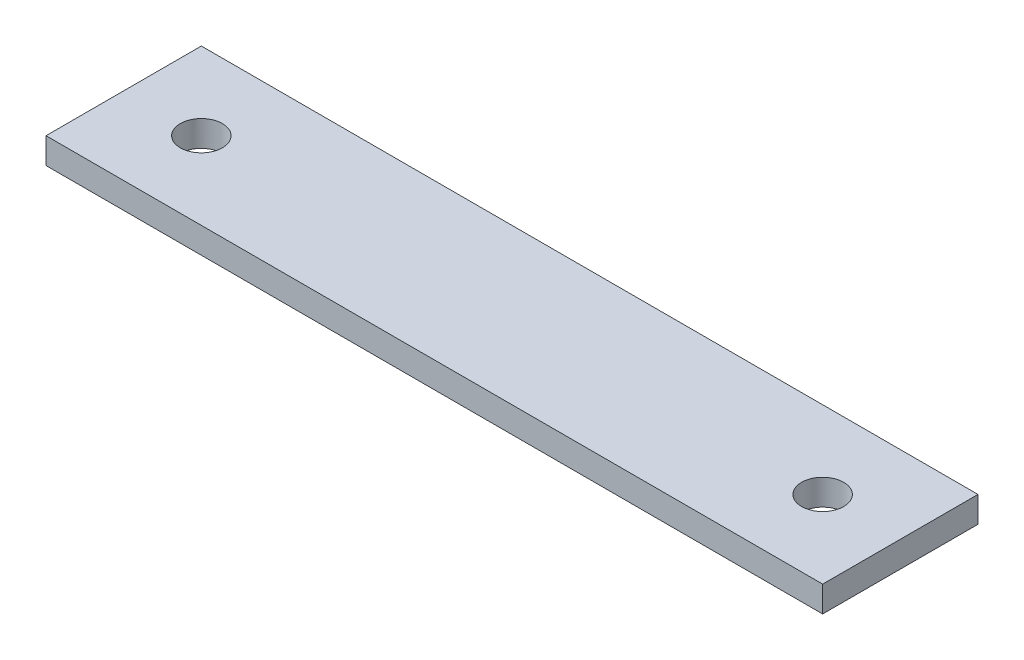
ISO-10303-21;
HEADER;
FILE_DESCRIPTION(('STEP AP214'),'2;1');
FILE_NAME('part.step','',(''),(''),'','','');
FILE_SCHEMA(('AUTOMOTIVE_DESIGN { 1 0 10303 214 1 1 1 1 }'));
ENDSEC;
DATA;
#1=APPLICATION_CONTEXT('core data for automotive mechanical design processes');
#2=APPLICATION_PROTOCOL_DEFINITION('international standard','automotive_design',2000,#1);
#3=PRODUCT_CONTEXT('',#1,'mechanical');
#4=PRODUCT('Part','Part','',(#3));
#5=PRODUCT_RELATED_PRODUCT_CATEGORY('part','',(#4));
#6=PRODUCT_DEFINITION_FORMATION('','',#4);
#7=PRODUCT_DEFINITION_CONTEXT('part definition',#1,'design');
#8=PRODUCT_DEFINITION('design','',#6,#7);
#9=PRODUCT_DEFINITION_SHAPE('','',#8);
#10=(LENGTH_UNIT() NAMED_UNIT(*) SI_UNIT(.MILLI.,.METRE.));
#11=(NAMED_UNIT(*) PLANE_ANGLE_UNIT() SI_UNIT($,.RADIAN.));
#12=(NAMED_UNIT(*) SI_UNIT($,.STERADIAN.) SOLID_ANGLE_UNIT());
#13=UNCERTAINTY_MEASURE_WITH_UNIT(LENGTH_MEASURE(1.E-05),#10,'distance_accuracy_value','');
#14=(GEOMETRIC_REPRESENTATION_CONTEXT(3) GLOBAL_UNCERTAINTY_ASSIGNED_CONTEXT((#13)) GLOBAL_UNIT_ASSIGNED_CONTEXT((#10,
#11,#12)) REPRESENTATION_CONTEXT('',''));
#15=CARTESIAN_POINT('',(0.,0.,0.));
#16=DIRECTION('',(0.,0.,1.));
#17=DIRECTION('',(1.,0.,0.));
#18=AXIS2_PLACEMENT_3D('',#15,#16,#17);
#19=CARTESIAN_POINT('',(0.,12.7,0.));
#20=DIRECTION('',(1.,0.,0.));
#21=DIRECTION('',(0.,0.,-1.));
#22=AXIS2_PLACEMENT_3D('',#19,#20,#21);
#23=PLANE('',#22);
#24=DIRECTION('',(0.,0.,1.));
#25=VECTOR('',#24,1.);
#26=CARTESIAN_POINT('',(0.,0.,0.));
#27=LINE('',#26,#25);
#28=CARTESIAN_POINT('',(0.,0.,-76.2));
#29=VERTEX_POINT('',#28);
#30=CARTESIAN_POINT('',(0.,0.,0.));
#31=VERTEX_POINT('',#30);
#32=EDGE_CURVE('E97',#29,#31,#27,.T.);
#33=ORIENTED_EDGE('',*,*,#32,.T.);
#34=DIRECTION('',(0.,-1.,0.));
#35=VECTOR('',#34,1.);
#36=CARTESIAN_POINT('',(0.,12.7,0.));
#37=LINE('',#36,#35);
#38=CARTESIAN_POINT('',(0.,12.7,0.));
#39=VERTEX_POINT('',#38);
#40=EDGE_CURVE('E11',#39,#31,#37,.T.);
#41=ORIENTED_EDGE('',*,*,#40,.F.);
#42=DIRECTION('',(0.,0.,1.));
#43=VECTOR('',#42,1.);
#44=CARTESIAN_POINT('',(0.,12.7,0.));
#45=LINE('',#44,#43);
#46=CARTESIAN_POINT('',(0.,12.7,-76.2));
#47=VERTEX_POINT('',#46);
#48=EDGE_CURVE('E85',#47,#39,#45,.T.);
#49=ORIENTED_EDGE('',*,*,#48,.F.);
#50=DIRECTION('',(0.,-1.,0.));
#51=VECTOR('',#50,1.);
#52=CARTESIAN_POINT('',(0.,12.7,-76.2));
#53=LINE('',#52,#51);
#54=EDGE_CURVE('E93',#47,#29,#53,.T.);
#55=ORIENTED_EDGE('',*,*,#54,.T.);
#56=EDGE_LOOP('',(#33,#41,#49,#55));
#57=FACE_BOUND('',#56,.T.);
#58=ADVANCED_FACE('F34',(#57),#23,.F.);
#59=CARTESIAN_POINT('',(0.,12.7,0.));
#60=DIRECTION('',(0.,0.,-1.));
#61=DIRECTION('',(-1.,0.,0.));
#62=AXIS2_PLACEMENT_3D('',#59,#60,#61);
#63=PLANE('',#62);
#64=DIRECTION('',(1.,0.,0.));
#65=VECTOR('',#64,1.);
#66=CARTESIAN_POINT('',(0.,0.,0.));
#67=LINE('',#66,#65);
#68=CARTESIAN_POINT('',(381.,0.,0.));
#69=VERTEX_POINT('',#68);
#70=EDGE_CURVE('E89',#31,#69,#67,.T.);
#71=ORIENTED_EDGE('',*,*,#70,.T.);
#72=DIRECTION('',(0.,-1.,0.));
#73=VECTOR('',#72,1.);
#74=CARTESIAN_POINT('',(381.,12.7,0.));
#75=LINE('',#74,#73);
#76=CARTESIAN_POINT('',(381.,12.7,0.));
#77=VERTEX_POINT('',#76);
#78=EDGE_CURVE('E42',#77,#69,#75,.T.);
#79=ORIENTED_EDGE('',*,*,#78,.F.);
#80=DIRECTION('',(1.,0.,0.));
#81=VECTOR('',#80,1.);
#82=CARTESIAN_POINT('',(0.,12.7,0.));
#83=LINE('',#82,#81);
#84=EDGE_CURVE('E80',#39,#77,#83,.T.);
#85=ORIENTED_EDGE('',*,*,#84,.F.);
#86=ORIENTED_EDGE('',*,*,#40,.T.);
#87=EDGE_LOOP('',(#71,#79,#85,#86));
#88=FACE_BOUND('',#87,.T.);
#89=ADVANCED_FACE('F88',(#88),#63,.F.);
#90=CARTESIAN_POINT('',(381.,12.7,0.));
#91=DIRECTION('',(-1.,0.,0.));
#92=DIRECTION('',(0.,0.,1.));
#93=AXIS2_PLACEMENT_3D('',#90,#91,#92);
#94=PLANE('',#93);
#95=DIRECTION('',(0.,0.,-1.));
#96=VECTOR('',#95,1.);
#97=CARTESIAN_POINT('',(381.,0.,0.));
#98=LINE('',#97,#96);
#99=CARTESIAN_POINT('',(381.,0.,-76.2));
#100=VERTEX_POINT('',#99);
#101=EDGE_CURVE('E67',#69,#100,#98,.T.);
#102=ORIENTED_EDGE('',*,*,#101,.T.);
#103=DIRECTION('',(0.,-1.,0.));
#104=VECTOR('',#103,1.);
#105=CARTESIAN_POINT('',(381.,12.7,-76.2));
#106=LINE('',#105,#104);
#107=CARTESIAN_POINT('',(381.,12.7,-76.2));
#108=VERTEX_POINT('',#107);
#109=EDGE_CURVE('E90',#108,#100,#106,.T.);
#110=ORIENTED_EDGE('',*,*,#109,.F.);
#111=DIRECTION('',(0.,0.,-1.));
#112=VECTOR('',#111,1.);
#113=CARTESIAN_POINT('',(381.,12.7,0.));
#114=LINE('',#113,#112);
#115=EDGE_CURVE('E83',#77,#108,#114,.T.);
#116=ORIENTED_EDGE('',*,*,#115,.F.);
#117=ORIENTED_EDGE('',*,*,#78,.T.);
#118=EDGE_LOOP('',(#102,#110,#116,#117));
#119=FACE_BOUND('',#118,.T.);
#120=ADVANCED_FACE('F91',(#119),#94,.F.);
#121=CARTESIAN_POINT('',(0.,12.7,-76.2));
#122=DIRECTION('',(0.,0.,1.));
#123=DIRECTION('',(1.,0.,0.));
#124=AXIS2_PLACEMENT_3D('',#121,#122,#123);
#125=PLANE('',#124);
#126=DIRECTION('',(-1.,0.,0.));
#127=VECTOR('',#126,1.);
#128=CARTESIAN_POINT('',(0.,0.,-76.2));
#129=LINE('',#128,#127);
#130=EDGE_CURVE('E73',#100,#29,#129,.T.);
#131=ORIENTED_EDGE('',*,*,#130,.T.);
#132=ORIENTED_EDGE('',*,*,#54,.F.);
#133=DIRECTION('',(-1.,0.,0.));
#134=VECTOR('',#133,1.);
#135=CARTESIAN_POINT('',(0.,12.7,-76.2));
#136=LINE('',#135,#134);
#137=EDGE_CURVE('E50',#108,#47,#136,.T.);
#138=ORIENTED_EDGE('',*,*,#137,.F.);
#139=ORIENTED_EDGE('',*,*,#109,.T.);
#140=EDGE_LOOP('',(#131,#132,#138,#139));
#141=FACE_BOUND('',#140,.T.);
#142=ADVANCED_FACE('F105',(#141),#125,.F.);
#143=CARTESIAN_POINT('',(0.,12.7,-76.2));
#144=DIRECTION('',(0.,-1.,0.));
#145=DIRECTION('',(0.,0.,-1.));
#146=AXIS2_PLACEMENT_3D('',#143,#144,#145);
#147=PLANE('',#146);
#148=CARTESIAN_POINT('',(342.9,12.7,-38.1));
#149=DIRECTION('',(0.,1.,0.));
#150=DIRECTION('',(0.,0.,-1.));
#151=AXIS2_PLACEMENT_3D('',#148,#149,#150);
#152=CIRCLE('',#151,10.31875);
#153=CARTESIAN_POINT('',(342.9,12.7,-48.4187500000001));
#154=VERTEX_POINT('',#153);
#155=EDGE_CURVE('E114',#154,#154,#152,.T.);
#156=ORIENTED_EDGE('',*,*,#155,.F.);
#157=EDGE_LOOP('',(#156));
#158=FACE_BOUND('',#157,.T.);
#159=CARTESIAN_POINT('',(38.1,12.7,-38.1));
#160=DIRECTION('',(0.,1.,0.));
#161=DIRECTION('',(0.,0.,1.));
#162=AXIS2_PLACEMENT_3D('',#159,#160,#161);
#163=CIRCLE('',#162,10.31875);
#164=CARTESIAN_POINT('',(38.1,12.7,-27.78125));
#165=VERTEX_POINT('',#164);
#166=EDGE_CURVE('E100',#165,#165,#163,.T.);
#167=ORIENTED_EDGE('',*,*,#166,.F.);
#168=EDGE_LOOP('',(#167));
#169=FACE_BOUND('',#168,.T.);
#170=ORIENTED_EDGE('',*,*,#48,.T.);
#171=ORIENTED_EDGE('',*,*,#84,.T.);
#172=ORIENTED_EDGE('',*,*,#115,.T.);
#173=ORIENTED_EDGE('',*,*,#137,.T.);
#174=EDGE_LOOP('',(#170,#171,#172,#173));
#175=FACE_BOUND('',#174,.T.);
#176=ADVANCED_FACE('F81',(#158,#169,#175),#147,.F.);
#177=CARTESIAN_POINT('',(0.,0.,-76.2));
#178=DIRECTION('',(0.,-1.,0.));
#179=DIRECTION('',(0.,0.,-1.));
#180=AXIS2_PLACEMENT_3D('',#177,#178,#179);
#181=PLANE('',#180);
#182=CARTESIAN_POINT('',(342.9,0.,-38.1));
#183=DIRECTION('',(0.,-1.,0.));
#184=DIRECTION('',(0.,0.,-1.));
#185=AXIS2_PLACEMENT_3D('',#182,#183,#184);
#186=CIRCLE('',#185,10.31875);
#187=CARTESIAN_POINT('',(342.9,0.,-48.4187500000001));
#188=VERTEX_POINT('',#187);
#189=EDGE_CURVE('E117',#188,#188,#186,.F.);
#190=ORIENTED_EDGE('',*,*,#189,.T.);
#191=EDGE_LOOP('',(#190));
#192=FACE_BOUND('',#191,.T.);
#193=CARTESIAN_POINT('',(38.1,0.,-38.1));
#194=DIRECTION('',(0.,-1.,0.));
#195=DIRECTION('',(0.,0.,-1.));
#196=AXIS2_PLACEMENT_3D('',#193,#194,#195);
#197=CIRCLE('',#196,10.31875);
#198=CARTESIAN_POINT('',(38.1,0.,-48.41875));
#199=VERTEX_POINT('',#198);
#200=EDGE_CURVE('E111',#199,#199,#197,.F.);
#201=ORIENTED_EDGE('',*,*,#200,.T.);
#202=EDGE_LOOP('',(#201));
#203=FACE_BOUND('',#202,.T.);
#204=ORIENTED_EDGE('',*,*,#32,.F.);
#205=ORIENTED_EDGE('',*,*,#130,.F.);
#206=ORIENTED_EDGE('',*,*,#101,.F.);
#207=ORIENTED_EDGE('',*,*,#70,.F.);
#208=EDGE_LOOP('',(#204,#205,#206,#207));
#209=FACE_BOUND('',#208,.T.);
#210=ADVANCED_FACE('F108',(#192,#203,#209),#181,.T.);
#211=CARTESIAN_POINT('',(38.1,-0.000999999999999265,-38.1));
#212=DIRECTION('',(0.,1.,0.));
#213=DIRECTION('',(0.,0.,1.));
#214=AXIS2_PLACEMENT_3D('',#211,#212,#213);
#215=CYLINDRICAL_SURFACE('',#214,10.31875);
#216=ORIENTED_EDGE('',*,*,#200,.F.);
#217=EDGE_LOOP('',(#216));
#218=FACE_BOUND('',#217,.T.);
#219=ORIENTED_EDGE('',*,*,#166,.T.);
#220=EDGE_LOOP('',(#219));
#221=FACE_BOUND('',#220,.T.);
#222=ADVANCED_FACE('F130',(#218,#221),#215,.F.);
#223=CARTESIAN_POINT('',(342.9,-0.000999999999999265,-38.1));
#224=DIRECTION('',(0.,1.,0.));
#225=DIRECTION('',(0.,0.,1.));
#226=AXIS2_PLACEMENT_3D('',#223,#224,#225);
#227=CYLINDRICAL_SURFACE('',#226,10.31875);
#228=ORIENTED_EDGE('',*,*,#189,.F.);
#229=EDGE_LOOP('',(#228));
#230=FACE_BOUND('',#229,.T.);
#231=ORIENTED_EDGE('',*,*,#155,.T.);
#232=EDGE_LOOP('',(#231));
#233=FACE_BOUND('',#232,.T.);
#234=ADVANCED_FACE('F123',(#230,#233),#227,.F.);
#235=CLOSED_SHELL('',(#58,#89,#120,#142,#176,#210,#222,#234));
#236=MANIFOLD_SOLID_BREP('B2',#235);
#237=ADVANCED_BREP_SHAPE_REPRESENTATION('',(#18,#236),#14);
#238=SHAPE_DEFINITION_REPRESENTATION(#9,#237);
ENDSEC;
END-ISO-10303-21;
